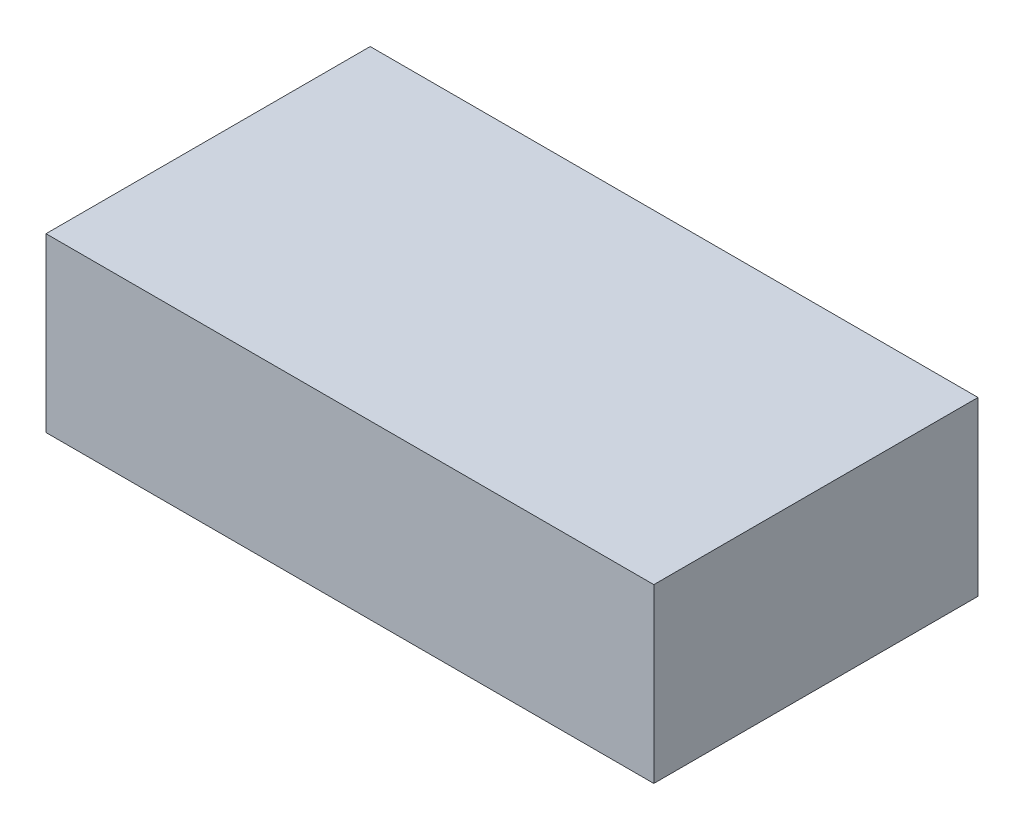
ISO-10303-21;
HEADER;
FILE_DESCRIPTION(('STEP AP214'),'2;1');
FILE_NAME('part.step','',(''),(''),'','','');
FILE_SCHEMA(('AUTOMOTIVE_DESIGN { 1 0 10303 214 1 1 1 1 }'));
ENDSEC;
DATA;
#1=APPLICATION_CONTEXT('core data for automotive mechanical design processes');
#2=APPLICATION_PROTOCOL_DEFINITION('international standard','automotive_design',2000,#1);
#3=PRODUCT_CONTEXT('',#1,'mechanical');
#4=PRODUCT('Part','Part','',(#3));
#5=PRODUCT_RELATED_PRODUCT_CATEGORY('part','',(#4));
#6=PRODUCT_DEFINITION_FORMATION('','',#4);
#7=PRODUCT_DEFINITION_CONTEXT('part definition',#1,'design');
#8=PRODUCT_DEFINITION('design','',#6,#7);
#9=PRODUCT_DEFINITION_SHAPE('','',#8);
#10=(LENGTH_UNIT() NAMED_UNIT(*) SI_UNIT(.MILLI.,.METRE.));
#11=(NAMED_UNIT(*) PLANE_ANGLE_UNIT() SI_UNIT($,.RADIAN.));
#12=(NAMED_UNIT(*) SI_UNIT($,.STERADIAN.) SOLID_ANGLE_UNIT());
#13=UNCERTAINTY_MEASURE_WITH_UNIT(LENGTH_MEASURE(1.E-05),#10,'distance_accuracy_value','');
#14=(GEOMETRIC_REPRESENTATION_CONTEXT(3) GLOBAL_UNCERTAINTY_ASSIGNED_CONTEXT((#13)) GLOBAL_UNIT_ASSIGNED_CONTEXT((#10,
#11,#12)) REPRESENTATION_CONTEXT('',''));
#15=CARTESIAN_POINT('',(0.,0.,0.));
#16=DIRECTION('',(0.,0.,1.));
#17=DIRECTION('',(1.,0.,0.));
#18=AXIS2_PLACEMENT_3D('',#15,#16,#17);
#19=CARTESIAN_POINT('',(-76.2,21.59,-40.64));
#20=DIRECTION('',(1.,0.,0.));
#21=DIRECTION('',(0.,0.,-1.));
#22=AXIS2_PLACEMENT_3D('',#19,#20,#21);
#23=PLANE('',#22);
#24=DIRECTION('',(0.,0.,1.));
#25=VECTOR('',#24,1.);
#26=CARTESIAN_POINT('',(-76.2,-21.59,-40.64));
#27=LINE('',#26,#25);
#28=CARTESIAN_POINT('',(-76.2,-21.59,-40.64));
#29=VERTEX_POINT('',#28);
#30=CARTESIAN_POINT('',(-76.2,-21.59,40.64));
#31=VERTEX_POINT('',#30);
#32=EDGE_CURVE('E93',#29,#31,#27,.T.);
#33=ORIENTED_EDGE('',*,*,#32,.T.);
#34=DIRECTION('',(0.,-1.,0.));
#35=VECTOR('',#34,1.);
#36=CARTESIAN_POINT('',(-76.2,21.59,40.64));
#37=LINE('',#36,#35);
#38=CARTESIAN_POINT('',(-76.2,21.59,40.64));
#39=VERTEX_POINT('',#38);
#40=EDGE_CURVE('E11',#39,#31,#37,.T.);
#41=ORIENTED_EDGE('',*,*,#40,.F.);
#42=DIRECTION('',(0.,0.,1.));
#43=VECTOR('',#42,1.);
#44=CARTESIAN_POINT('',(-76.2,21.59,-40.64));
#45=LINE('',#44,#43);
#46=CARTESIAN_POINT('',(-76.2,21.59,-40.64));
#47=VERTEX_POINT('',#46);
#48=EDGE_CURVE('E81',#47,#39,#45,.T.);
#49=ORIENTED_EDGE('',*,*,#48,.F.);
#50=DIRECTION('',(0.,-1.,0.));
#51=VECTOR('',#50,1.);
#52=CARTESIAN_POINT('',(-76.2,21.59,-40.64));
#53=LINE('',#52,#51);
#54=EDGE_CURVE('E89',#47,#29,#53,.T.);
#55=ORIENTED_EDGE('',*,*,#54,.T.);
#56=EDGE_LOOP('',(#33,#41,#49,#55));
#57=FACE_BOUND('',#56,.T.);
#58=ADVANCED_FACE('F30',(#57),#23,.F.);
#59=CARTESIAN_POINT('',(-76.2,21.59,40.64));
#60=DIRECTION('',(0.,0.,-1.));
#61=DIRECTION('',(-1.,0.,0.));
#62=AXIS2_PLACEMENT_3D('',#59,#60,#61);
#63=PLANE('',#62);
#64=DIRECTION('',(1.,0.,0.));
#65=VECTOR('',#64,1.);
#66=CARTESIAN_POINT('',(-76.2,-21.59,40.64));
#67=LINE('',#66,#65);
#68=CARTESIAN_POINT('',(76.2,-21.59,40.64));
#69=VERTEX_POINT('',#68);
#70=EDGE_CURVE('E85',#31,#69,#67,.T.);
#71=ORIENTED_EDGE('',*,*,#70,.T.);
#72=DIRECTION('',(0.,-1.,0.));
#73=VECTOR('',#72,1.);
#74=CARTESIAN_POINT('',(76.2,21.59,40.64));
#75=LINE('',#74,#73);
#76=CARTESIAN_POINT('',(76.2,21.59,40.64));
#77=VERTEX_POINT('',#76);
#78=EDGE_CURVE('E38',#77,#69,#75,.T.);
#79=ORIENTED_EDGE('',*,*,#78,.F.);
#80=DIRECTION('',(1.,0.,0.));
#81=VECTOR('',#80,1.);
#82=CARTESIAN_POINT('',(-76.2,21.59,40.64));
#83=LINE('',#82,#81);
#84=EDGE_CURVE('E76',#39,#77,#83,.T.);
#85=ORIENTED_EDGE('',*,*,#84,.F.);
#86=ORIENTED_EDGE('',*,*,#40,.T.);
#87=EDGE_LOOP('',(#71,#79,#85,#86));
#88=FACE_BOUND('',#87,.T.);
#89=ADVANCED_FACE('F84',(#88),#63,.F.);
#90=CARTESIAN_POINT('',(76.2,21.59,-40.64));
#91=DIRECTION('',(-1.,0.,0.));
#92=DIRECTION('',(0.,0.,1.));
#93=AXIS2_PLACEMENT_3D('',#90,#91,#92);
#94=PLANE('',#93);
#95=DIRECTION('',(0.,0.,-1.));
#96=VECTOR('',#95,1.);
#97=CARTESIAN_POINT('',(76.2,-21.59,-40.64));
#98=LINE('',#97,#96);
#99=CARTESIAN_POINT('',(76.2,-21.59,-40.64));
#100=VERTEX_POINT('',#99);
#101=EDGE_CURVE('E63',#69,#100,#98,.T.);
#102=ORIENTED_EDGE('',*,*,#101,.T.);
#103=DIRECTION('',(0.,-1.,0.));
#104=VECTOR('',#103,1.);
#105=CARTESIAN_POINT('',(76.2,21.59,-40.64));
#106=LINE('',#105,#104);
#107=CARTESIAN_POINT('',(76.2,21.59,-40.64));
#108=VERTEX_POINT('',#107);
#109=EDGE_CURVE('E86',#108,#100,#106,.T.);
#110=ORIENTED_EDGE('',*,*,#109,.F.);
#111=DIRECTION('',(0.,0.,-1.));
#112=VECTOR('',#111,1.);
#113=CARTESIAN_POINT('',(76.2,21.59,-40.64));
#114=LINE('',#113,#112);
#115=EDGE_CURVE('E79',#77,#108,#114,.T.);
#116=ORIENTED_EDGE('',*,*,#115,.F.);
#117=ORIENTED_EDGE('',*,*,#78,.T.);
#118=EDGE_LOOP('',(#102,#110,#116,#117));
#119=FACE_BOUND('',#118,.T.);
#120=ADVANCED_FACE('F87',(#119),#94,.F.);
#121=CARTESIAN_POINT('',(-76.2,21.59,-40.64));
#122=DIRECTION('',(0.,0.,1.));
#123=DIRECTION('',(1.,0.,0.));
#124=AXIS2_PLACEMENT_3D('',#121,#122,#123);
#125=PLANE('',#124);
#126=DIRECTION('',(-1.,0.,0.));
#127=VECTOR('',#126,1.);
#128=CARTESIAN_POINT('',(-76.2,-21.59,-40.64));
#129=LINE('',#128,#127);
#130=EDGE_CURVE('E69',#100,#29,#129,.T.);
#131=ORIENTED_EDGE('',*,*,#130,.T.);
#132=ORIENTED_EDGE('',*,*,#54,.F.);
#133=DIRECTION('',(-1.,0.,0.));
#134=VECTOR('',#133,1.);
#135=CARTESIAN_POINT('',(-76.2,21.59,-40.64));
#136=LINE('',#135,#134);
#137=EDGE_CURVE('E46',#108,#47,#136,.T.);
#138=ORIENTED_EDGE('',*,*,#137,.F.);
#139=ORIENTED_EDGE('',*,*,#109,.T.);
#140=EDGE_LOOP('',(#131,#132,#138,#139));
#141=FACE_BOUND('',#140,.T.);
#142=ADVANCED_FACE('F100',(#141),#125,.F.);
#143=CARTESIAN_POINT('',(-76.2,21.59,40.64));
#144=DIRECTION('',(0.,1.,0.));
#145=DIRECTION('',(0.,0.,1.));
#146=AXIS2_PLACEMENT_3D('',#143,#144,#145);
#147=PLANE('',#146);
#148=ORIENTED_EDGE('',*,*,#48,.T.);
#149=ORIENTED_EDGE('',*,*,#84,.T.);
#150=ORIENTED_EDGE('',*,*,#115,.T.);
#151=ORIENTED_EDGE('',*,*,#137,.T.);
#152=EDGE_LOOP('',(#148,#149,#150,#151));
#153=FACE_BOUND('',#152,.T.);
#154=ADVANCED_FACE('F77',(#153),#147,.T.);
#155=CARTESIAN_POINT('',(-76.2,-21.59,40.64));
#156=DIRECTION('',(0.,1.,0.));
#157=DIRECTION('',(0.,0.,1.));
#158=AXIS2_PLACEMENT_3D('',#155,#156,#157);
#159=PLANE('',#158);
#160=ORIENTED_EDGE('',*,*,#32,.F.);
#161=ORIENTED_EDGE('',*,*,#130,.F.);
#162=ORIENTED_EDGE('',*,*,#101,.F.);
#163=ORIENTED_EDGE('',*,*,#70,.F.);
#164=EDGE_LOOP('',(#160,#161,#162,#163));
#165=FACE_BOUND('',#164,.T.);
#166=ADVANCED_FACE('F103',(#165),#159,.F.);
#167=CLOSED_SHELL('',(#58,#89,#120,#142,#154,#166));
#168=MANIFOLD_SOLID_BREP('B2',#167);
#169=ADVANCED_BREP_SHAPE_REPRESENTATION('',(#18,#168),#14);
#170=SHAPE_DEFINITION_REPRESENTATION(#9,#169);
ENDSEC;
END-ISO-10303-21;
